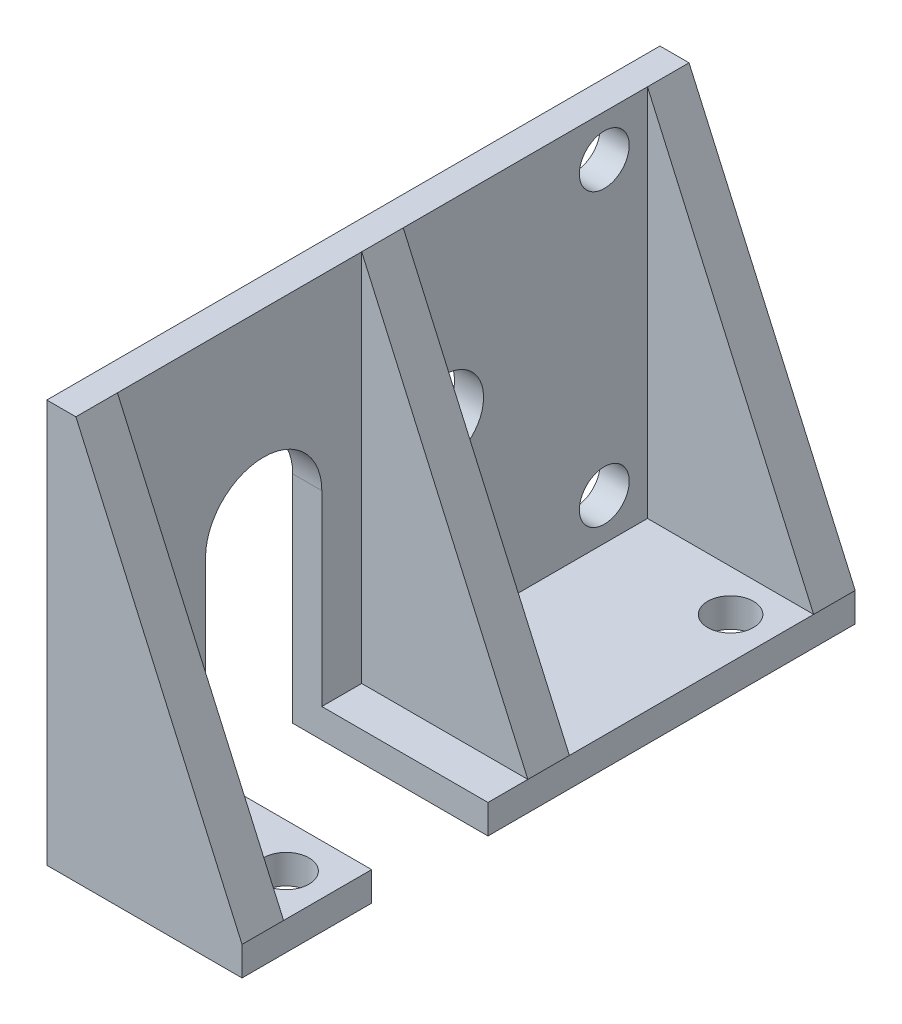
ISO-10303-21;
HEADER;
FILE_DESCRIPTION(('STEP AP214'),'2;1');
FILE_NAME('part.step','',(''),(''),'','','');
FILE_SCHEMA(('AUTOMOTIVE_DESIGN { 1 0 10303 214 1 1 1 1 }'));
ENDSEC;
DATA;
#1=APPLICATION_CONTEXT('core data for automotive mechanical design processes');
#2=APPLICATION_PROTOCOL_DEFINITION('international standard','automotive_design',2000,#1);
#3=PRODUCT_CONTEXT('',#1,'mechanical');
#4=PRODUCT('Part','Part','',(#3));
#5=PRODUCT_RELATED_PRODUCT_CATEGORY('part','',(#4));
#6=PRODUCT_DEFINITION_FORMATION('','',#4);
#7=PRODUCT_DEFINITION_CONTEXT('part definition',#1,'design');
#8=PRODUCT_DEFINITION('design','',#6,#7);
#9=PRODUCT_DEFINITION_SHAPE('','',#8);
#10=(LENGTH_UNIT() NAMED_UNIT(*) SI_UNIT(.MILLI.,.METRE.));
#11=(NAMED_UNIT(*) PLANE_ANGLE_UNIT() SI_UNIT($,.RADIAN.));
#12=(NAMED_UNIT(*) SI_UNIT($,.STERADIAN.) SOLID_ANGLE_UNIT());
#13=UNCERTAINTY_MEASURE_WITH_UNIT(LENGTH_MEASURE(1.E-05),#10,'distance_accuracy_value','');
#14=(GEOMETRIC_REPRESENTATION_CONTEXT(3) GLOBAL_UNCERTAINTY_ASSIGNED_CONTEXT((#13)) GLOBAL_UNIT_ASSIGNED_CONTEXT((#10,
#11,#12)) REPRESENTATION_CONTEXT('',''));
#15=CARTESIAN_POINT('',(0.,0.,0.));
#16=DIRECTION('',(0.,0.,1.));
#17=DIRECTION('',(1.,0.,0.));
#18=AXIS2_PLACEMENT_3D('',#15,#16,#17);
#19=CARTESIAN_POINT('',(0.,0.,0.));
#20=DIRECTION('',(0.,-1.,0.));
#21=DIRECTION('',(0.,0.,-1.));
#22=AXIS2_PLACEMENT_3D('',#19,#20,#21);
#23=PLANE('',#22);
#24=CARTESIAN_POINT('',(9.25000000000001,0.,-5.14999999999999));
#25=DIRECTION('',(0.,1.,0.));
#26=DIRECTION('',(0.,0.,-1.));
#27=AXIS2_PLACEMENT_3D('',#24,#25,#26);
#28=CIRCLE('',#27,1.375);
#29=CARTESIAN_POINT('',(9.25000000000001,0.,-6.52499999999999));
#30=VERTEX_POINT('',#29);
#31=EDGE_CURVE('E810',#30,#30,#28,.T.);
#32=ORIENTED_EDGE('',*,*,#31,.F.);
#33=EDGE_LOOP('',(#32));
#34=FACE_BOUND('',#33,.T.);
#35=DIRECTION('',(0.,0.,1.));
#36=VECTOR('',#35,1.);
#37=CARTESIAN_POINT('',(11.75,0.,0.));
#38=LINE('',#37,#36);
#39=CARTESIAN_POINT('',(11.75,0.,-7.79999999999999));
#40=VERTEX_POINT('',#39);
#41=CARTESIAN_POINT('',(11.75,0.,-2.5));
#42=VERTEX_POINT('',#41);
#43=EDGE_CURVE('E317',#40,#42,#38,.T.);
#44=ORIENTED_EDGE('',*,*,#43,.F.);
#45=DIRECTION('',(-1.,0.,0.));
#46=VECTOR('',#45,1.);
#47=CARTESIAN_POINT('',(0.,0.,-7.79999999999999));
#48=LINE('',#47,#46);
#49=CARTESIAN_POINT('',(1.75,0.,-7.79999999999999));
#50=VERTEX_POINT('',#49);
#51=EDGE_CURVE('E213',#40,#50,#48,.T.);
#52=ORIENTED_EDGE('',*,*,#51,.T.);
#53=DIRECTION('',(0.,0.,-1.));
#54=VECTOR('',#53,1.);
#55=CARTESIAN_POINT('',(1.75,0.,0.));
#56=LINE('',#55,#54);
#57=CARTESIAN_POINT('',(1.75,0.,-2.5));
#58=VERTEX_POINT('',#57);
#59=EDGE_CURVE('E326',#58,#50,#56,.T.);
#60=ORIENTED_EDGE('',*,*,#59,.F.);
#61=DIRECTION('',(-1.,0.,0.));
#62=VECTOR('',#61,1.);
#63=CARTESIAN_POINT('',(0.,0.,-2.5));
#64=LINE('',#63,#62);
#65=EDGE_CURVE('E11',#42,#58,#64,.T.);
#66=ORIENTED_EDGE('',*,*,#65,.F.);
#67=EDGE_LOOP('',(#44,#52,#60,#66));
#68=FACE_BOUND('',#67,.T.);
#69=ADVANCED_FACE('F38',(#34,#68),#23,.F.);
#70=CARTESIAN_POINT('',(11.75,-1.75,0.));
#71=DIRECTION('',(-1.,0.,0.));
#72=DIRECTION('',(0.,0.,1.));
#73=AXIS2_PLACEMENT_3D('',#70,#71,#72);
#74=PLANE('',#73);
#75=DIRECTION('',(0.,0.,1.));
#76=VECTOR('',#75,1.);
#77=CARTESIAN_POINT('',(11.75,-1.75,0.));
#78=LINE('',#77,#76);
#79=CARTESIAN_POINT('',(11.75,-1.75,-7.79999999999999));
#80=VERTEX_POINT('',#79);
#81=CARTESIAN_POINT('',(11.75,-1.75,0.));
#82=VERTEX_POINT('',#81);
#83=EDGE_CURVE('E302',#80,#82,#78,.T.);
#84=ORIENTED_EDGE('',*,*,#83,.F.);
#85=DIRECTION('',(0.,-1.,0.));
#86=VECTOR('',#85,1.);
#87=CARTESIAN_POINT('',(11.75,-1.75,-7.79999999999999));
#88=LINE('',#87,#86);
#89=EDGE_CURVE('E184',#40,#80,#88,.T.);
#90=ORIENTED_EDGE('',*,*,#89,.F.);
#91=ORIENTED_EDGE('',*,*,#43,.T.);
#92=CARTESIAN_POINT('',(11.75,0.,0.));
#93=VERTEX_POINT('',#92);
#94=EDGE_CURVE('E294',#42,#93,#38,.T.);
#95=ORIENTED_EDGE('',*,*,#94,.T.);
#96=DIRECTION('',(0.,1.,0.));
#97=VECTOR('',#96,1.);
#98=CARTESIAN_POINT('',(11.75,-1.75,0.));
#99=LINE('',#98,#97);
#100=EDGE_CURVE('E311',#82,#93,#99,.T.);
#101=ORIENTED_EDGE('',*,*,#100,.F.);
#102=EDGE_LOOP('',(#84,#90,#91,#95,#101));
#103=FACE_BOUND('',#102,.T.);
#104=ADVANCED_FACE('F373',(#103),#74,.F.);
#105=CARTESIAN_POINT('',(0.,-1.75,0.));
#106=DIRECTION('',(0.,-1.,0.));
#107=DIRECTION('',(0.,0.,-1.));
#108=AXIS2_PLACEMENT_3D('',#105,#106,#107);
#109=PLANE('',#108);
#110=CARTESIAN_POINT('',(9.25000000000001,-1.75,-5.14999999999999));
#111=DIRECTION('',(0.,1.,0.));
#112=DIRECTION('',(0.,0.,-1.));
#113=AXIS2_PLACEMENT_3D('',#110,#111,#112);
#114=CIRCLE('',#113,1.375);
#115=CARTESIAN_POINT('',(9.25000000000001,-1.75,-6.52499999999999));
#116=VERTEX_POINT('',#115);
#117=EDGE_CURVE('E806',#116,#116,#114,.T.);
#118=ORIENTED_EDGE('',*,*,#117,.T.);
#119=EDGE_LOOP('',(#118));
#120=FACE_BOUND('',#119,.T.);
#121=DIRECTION('',(1.,0.,0.));
#122=VECTOR('',#121,1.);
#123=CARTESIAN_POINT('',(0.,-1.75,-7.79999999999999));
#124=LINE('',#123,#122);
#125=CARTESIAN_POINT('',(0.,-1.75,-7.79999999999999));
#126=VERTEX_POINT('',#125);
#127=EDGE_CURVE('E199',#126,#80,#124,.T.);
#128=ORIENTED_EDGE('',*,*,#127,.T.);
#129=ORIENTED_EDGE('',*,*,#83,.T.);
#130=DIRECTION('',(-1.,0.,0.));
#131=VECTOR('',#130,1.);
#132=CARTESIAN_POINT('',(0.,-1.75,0.));
#133=LINE('',#132,#131);
#134=CARTESIAN_POINT('',(0.,-1.75,0.));
#135=VERTEX_POINT('',#134);
#136=EDGE_CURVE('E307',#82,#135,#133,.T.);
#137=ORIENTED_EDGE('',*,*,#136,.T.);
#138=DIRECTION('',(0.,0.,-1.));
#139=VECTOR('',#138,1.);
#140=CARTESIAN_POINT('',(0.,-1.75,0.));
#141=LINE('',#140,#139);
#142=EDGE_CURVE('E295',#135,#126,#141,.T.);
#143=ORIENTED_EDGE('',*,*,#142,.T.);
#144=EDGE_LOOP('',(#128,#129,#137,#143));
#145=FACE_BOUND('',#144,.T.);
#146=ADVANCED_FACE('F367',(#120,#145),#109,.T.);
#147=CARTESIAN_POINT('',(1.75,0.,0.));
#148=DIRECTION('',(-1.,0.,0.));
#149=DIRECTION('',(0.,0.,1.));
#150=AXIS2_PLACEMENT_3D('',#147,#148,#149);
#151=PLANE('',#150);
#152=CARTESIAN_POINT('',(1.75,11.25,-22.185));
#153=DIRECTION('',(1.,0.,0.));
#154=DIRECTION('',(0.,0.,1.));
#155=AXIS2_PLACEMENT_3D('',#152,#153,#154);
#156=CIRCLE('',#155,2.35);
#157=CARTESIAN_POINT('',(1.75,11.25,-19.835));
#158=VERTEX_POINT('',#157);
#159=EDGE_CURVE('E496',#158,#158,#156,.T.);
#160=ORIENTED_EDGE('',*,*,#159,.F.);
#161=EDGE_LOOP('',(#160));
#162=FACE_BOUND('',#161,.T.);
#163=CARTESIAN_POINT('',(1.75,2.5,-31.8));
#164=DIRECTION('',(1.,0.,0.));
#165=DIRECTION('',(0.,0.,1.));
#166=AXIS2_PLACEMENT_3D('',#163,#164,#165);
#167=CIRCLE('',#166,1.5);
#168=CARTESIAN_POINT('',(1.75,2.5,-30.3));
#169=VERTEX_POINT('',#168);
#170=EDGE_CURVE('E230',#169,#169,#167,.T.);
#171=ORIENTED_EDGE('',*,*,#170,.F.);
#172=EDGE_LOOP('',(#171));
#173=FACE_BOUND('',#172,.T.);
#174=CARTESIAN_POINT('',(1.75,20.,-31.8));
#175=DIRECTION('',(1.,0.,0.));
#176=DIRECTION('',(0.,0.,1.));
#177=AXIS2_PLACEMENT_3D('',#174,#175,#176);
#178=CIRCLE('',#177,1.5);
#179=CARTESIAN_POINT('',(1.75,20.,-30.3));
#180=VERTEX_POINT('',#179);
#181=EDGE_CURVE('E224',#180,#180,#178,.T.);
#182=ORIENTED_EDGE('',*,*,#181,.F.);
#183=EDGE_LOOP('',(#182));
#184=FACE_BOUND('',#183,.T.);
#185=DIRECTION('',(0.,1.,0.));
#186=VECTOR('',#185,1.);
#187=CARTESIAN_POINT('',(1.75,0.,-19.7));
#188=LINE('',#187,#186);
#189=CARTESIAN_POINT('',(1.75,0.,-19.7));
#190=VERTEX_POINT('',#189);
#191=CARTESIAN_POINT('',(1.75,22.5,-19.7));
#192=VERTEX_POINT('',#191);
#193=EDGE_CURVE('E249',#190,#192,#188,.T.);
#194=ORIENTED_EDGE('',*,*,#193,.F.);
#195=CARTESIAN_POINT('',(1.75,0.,-34.4));
#196=VERTEX_POINT('',#195);
#197=EDGE_CURVE('E332',#190,#196,#56,.T.);
#198=ORIENTED_EDGE('',*,*,#197,.T.);
#199=DIRECTION('',(0.,-1.,0.));
#200=VECTOR('',#199,1.);
#201=CARTESIAN_POINT('',(1.75,0.,-34.4));
#202=LINE('',#201,#200);
#203=CARTESIAN_POINT('',(1.75,22.5,-34.4));
#204=VERTEX_POINT('',#203);
#205=EDGE_CURVE('E274',#204,#196,#202,.T.);
#206=ORIENTED_EDGE('',*,*,#205,.F.);
#207=DIRECTION('',(0.,0.,1.));
#208=VECTOR('',#207,1.);
#209=CARTESIAN_POINT('',(1.75,22.5,0.));
#210=LINE('',#209,#208);
#211=EDGE_CURVE('E337',#204,#192,#210,.T.);
#212=ORIENTED_EDGE('',*,*,#211,.T.);
#213=EDGE_LOOP('',(#194,#198,#206,#212));
#214=FACE_BOUND('',#213,.T.);
#215=ADVANCED_FACE('F395',(#162,#173,#184,#214),#151,.F.);
#216=CARTESIAN_POINT('',(9.25,0.,-31.9));
#217=DIRECTION('',(0.,1.,0.));
#218=DIRECTION('',(0.,0.,-1.));
#219=AXIS2_PLACEMENT_3D('',#216,#217,#218);
#220=CIRCLE('',#219,1.375);
#221=CARTESIAN_POINT('',(9.25,0.,-33.275));
#222=VERTEX_POINT('',#221);
#223=EDGE_CURVE('E802',#222,#222,#220,.T.);
#224=ORIENTED_EDGE('',*,*,#223,.F.);
#225=EDGE_LOOP('',(#224));
#226=FACE_BOUND('',#225,.T.);
#227=CARTESIAN_POINT('',(4.25,0.,-22.2));
#228=DIRECTION('',(0.,1.,0.));
#229=DIRECTION('',(0.,0.,-1.));
#230=AXIS2_PLACEMENT_3D('',#227,#228,#229);
#231=CIRCLE('',#230,1.375);
#232=CARTESIAN_POINT('',(4.25,0.,-23.575));
#233=VERTEX_POINT('',#232);
#234=EDGE_CURVE('E191',#233,#233,#231,.T.);
#235=ORIENTED_EDGE('',*,*,#234,.F.);
#236=EDGE_LOOP('',(#235));
#237=FACE_BOUND('',#236,.T.);
#238=DIRECTION('',(-1.,0.,0.));
#239=VECTOR('',#238,1.);
#240=CARTESIAN_POINT('',(0.,0.,-19.7));
#241=LINE('',#240,#239);
#242=CARTESIAN_POINT('',(11.75,0.,-19.7));
#243=VERTEX_POINT('',#242);
#244=EDGE_CURVE('E243',#243,#190,#241,.T.);
#245=ORIENTED_EDGE('',*,*,#244,.F.);
#246=CARTESIAN_POINT('',(11.75,0.,-34.4));
#247=VERTEX_POINT('',#246);
#248=EDGE_CURVE('E316',#247,#243,#38,.T.);
#249=ORIENTED_EDGE('',*,*,#248,.F.);
#250=DIRECTION('',(1.,0.,0.));
#251=VECTOR('',#250,1.);
#252=CARTESIAN_POINT('',(0.,0.,-34.4));
#253=LINE('',#252,#251);
#254=EDGE_CURVE('E268',#196,#247,#253,.T.);
#255=ORIENTED_EDGE('',*,*,#254,.F.);
#256=ORIENTED_EDGE('',*,*,#197,.F.);
#257=EDGE_LOOP('',(#245,#249,#255,#256));
#258=FACE_BOUND('',#257,.T.);
#259=ADVANCED_FACE('F437',(#226,#237,#258),#23,.F.);
#260=ORIENTED_EDGE('',*,*,#59,.T.);
#261=DIRECTION('',(0.,1.,0.));
#262=VECTOR('',#261,1.);
#263=CARTESIAN_POINT('',(1.75,0.,-7.79999999999999));
#264=LINE('',#263,#262);
#265=CARTESIAN_POINT('',(1.75,11.25,-7.79999999999999));
#266=VERTEX_POINT('',#265);
#267=EDGE_CURVE('E217',#50,#266,#264,.T.);
#268=ORIENTED_EDGE('',*,*,#267,.T.);
#269=CARTESIAN_POINT('',(1.75,11.25,-11.3));
#270=DIRECTION('',(-1.,0.,0.));
#271=DIRECTION('',(0.,0.,1.));
#272=AXIS2_PLACEMENT_3D('',#269,#270,#271);
#273=CIRCLE('',#272,3.5);
#274=CARTESIAN_POINT('',(1.75,11.25,-14.8));
#275=VERTEX_POINT('',#274);
#276=EDGE_CURVE('E221',#266,#275,#273,.T.);
#277=ORIENTED_EDGE('',*,*,#276,.T.);
#278=DIRECTION('',(0.,-1.,0.));
#279=VECTOR('',#278,1.);
#280=CARTESIAN_POINT('',(1.75,0.,-14.8));
#281=LINE('',#280,#279);
#282=CARTESIAN_POINT('',(1.75,0.,-14.8));
#283=VERTEX_POINT('',#282);
#284=EDGE_CURVE('E161',#275,#283,#281,.T.);
#285=ORIENTED_EDGE('',*,*,#284,.T.);
#286=CARTESIAN_POINT('',(1.75,0.,-17.2));
#287=VERTEX_POINT('',#286);
#288=EDGE_CURVE('E331',#283,#287,#56,.T.);
#289=ORIENTED_EDGE('',*,*,#288,.T.);
#290=DIRECTION('',(0.,1.,0.));
#291=VECTOR('',#290,1.);
#292=CARTESIAN_POINT('',(1.75,0.,-17.2));
#293=LINE('',#292,#291);
#294=CARTESIAN_POINT('',(1.75,22.5,-17.2));
#295=VERTEX_POINT('',#294);
#296=EDGE_CURVE('E256',#287,#295,#293,.T.);
#297=ORIENTED_EDGE('',*,*,#296,.T.);
#298=CARTESIAN_POINT('',(1.75,22.5,-2.5));
#299=VERTEX_POINT('',#298);
#300=EDGE_CURVE('E330',#295,#299,#210,.T.);
#301=ORIENTED_EDGE('',*,*,#300,.T.);
#302=DIRECTION('',(0.,1.,0.));
#303=VECTOR('',#302,1.);
#304=CARTESIAN_POINT('',(1.75,0.,-2.5));
#305=LINE('',#304,#303);
#306=EDGE_CURVE('E283',#58,#299,#305,.T.);
#307=ORIENTED_EDGE('',*,*,#306,.F.);
#308=EDGE_LOOP('',(#260,#268,#277,#285,#289,#297,#301,#307));
#309=FACE_BOUND('',#308,.T.);
#310=ADVANCED_FACE('F385',(#309),#151,.F.);
#311=ORIENTED_EDGE('',*,*,#288,.F.);
#312=DIRECTION('',(1.,0.,0.));
#313=VECTOR('',#312,1.);
#314=CARTESIAN_POINT('',(0.,0.,-14.8));
#315=LINE('',#314,#313);
#316=CARTESIAN_POINT('',(11.75,0.,-14.8));
#317=VERTEX_POINT('',#316);
#318=EDGE_CURVE('E203',#283,#317,#315,.T.);
#319=ORIENTED_EDGE('',*,*,#318,.T.);
#320=CARTESIAN_POINT('',(11.75,0.,-17.2));
#321=VERTEX_POINT('',#320);
#322=EDGE_CURVE('E405',#321,#317,#38,.T.);
#323=ORIENTED_EDGE('',*,*,#322,.F.);
#324=DIRECTION('',(-1.,0.,0.));
#325=VECTOR('',#324,1.);
#326=CARTESIAN_POINT('',(0.,0.,-17.2));
#327=LINE('',#326,#325);
#328=EDGE_CURVE('E252',#321,#287,#327,.T.);
#329=ORIENTED_EDGE('',*,*,#328,.T.);
#330=EDGE_LOOP('',(#311,#319,#323,#329));
#331=FACE_BOUND('',#330,.T.);
#332=ADVANCED_FACE('F407',(#331),#23,.F.);
#333=CARTESIAN_POINT('',(1.75,0.,0.));
#334=DIRECTION('',(0.,0.,-1.));
#335=DIRECTION('',(-1.,0.,0.));
#336=AXIS2_PLACEMENT_3D('',#333,#334,#335);
#337=PLANE('',#336);
#338=DIRECTION('',(0.,-1.,0.));
#339=VECTOR('',#338,1.);
#340=CARTESIAN_POINT('',(0.,0.,0.));
#341=LINE('',#340,#339);
#342=CARTESIAN_POINT('',(0.,22.5,0.));
#343=VERTEX_POINT('',#342);
#344=EDGE_CURVE('E325',#343,#135,#341,.T.);
#345=ORIENTED_EDGE('',*,*,#344,.T.);
#346=ORIENTED_EDGE('',*,*,#136,.F.);
#347=ORIENTED_EDGE('',*,*,#100,.T.);
#348=DIRECTION('',(0.406138466053448,-0.913811548620257,0.));
#349=VECTOR('',#348,1.);
#350=CARTESIAN_POINT('',(1.75,22.5,0.));
#351=LINE('',#350,#349);
#352=CARTESIAN_POINT('',(1.75,22.5,0.));
#353=VERTEX_POINT('',#352);
#354=EDGE_CURVE('E279',#353,#93,#351,.T.);
#355=ORIENTED_EDGE('',*,*,#354,.F.);
#356=DIRECTION('',(-1.,0.,0.));
#357=VECTOR('',#356,1.);
#358=CARTESIAN_POINT('',(1.75,22.5,0.));
#359=LINE('',#358,#357);
#360=EDGE_CURVE('E336',#353,#343,#359,.T.);
#361=ORIENTED_EDGE('',*,*,#360,.T.);
#362=EDGE_LOOP('',(#345,#346,#347,#355,#361));
#363=FACE_BOUND('',#362,.T.);
#364=ADVANCED_FACE('F40',(#363),#337,.F.);
#365=CARTESIAN_POINT('',(1.75,0.,-36.9));
#366=DIRECTION('',(0.,0.,1.));
#367=DIRECTION('',(1.,0.,0.));
#368=AXIS2_PLACEMENT_3D('',#365,#366,#367);
#369=PLANE('',#368);
#370=DIRECTION('',(-1.,0.,0.));
#371=VECTOR('',#370,1.);
#372=CARTESIAN_POINT('',(1.75,22.5,-36.9));
#373=LINE('',#372,#371);
#374=CARTESIAN_POINT('',(1.75,22.5,-36.9));
#375=VERTEX_POINT('',#374);
#376=CARTESIAN_POINT('',(0.,22.5,-36.9));
#377=VERTEX_POINT('',#376);
#378=EDGE_CURVE('E48',#375,#377,#373,.T.);
#379=ORIENTED_EDGE('',*,*,#378,.F.);
#380=DIRECTION('',(0.406138466053448,-0.913811548620257,0.));
#381=VECTOR('',#380,1.);
#382=CARTESIAN_POINT('',(1.75,22.5,-36.9));
#383=LINE('',#382,#381);
#384=CARTESIAN_POINT('',(11.75,0.,-36.9));
#385=VERTEX_POINT('',#384);
#386=EDGE_CURVE('E264',#375,#385,#383,.T.);
#387=ORIENTED_EDGE('',*,*,#386,.T.);
#388=DIRECTION('',(0.,1.,0.));
#389=VECTOR('',#388,1.);
#390=CARTESIAN_POINT('',(11.75,-1.75,-36.9));
#391=LINE('',#390,#389);
#392=CARTESIAN_POINT('',(11.75,-1.75,-36.9));
#393=VERTEX_POINT('',#392);
#394=EDGE_CURVE('E321',#393,#385,#391,.T.);
#395=ORIENTED_EDGE('',*,*,#394,.F.);
#396=DIRECTION('',(1.,0.,0.));
#397=VECTOR('',#396,1.);
#398=CARTESIAN_POINT('',(0.,-1.75,-36.9));
#399=LINE('',#398,#397);
#400=CARTESIAN_POINT('',(0.,-1.75,-36.9));
#401=VERTEX_POINT('',#400);
#402=EDGE_CURVE('E299',#401,#393,#399,.T.);
#403=ORIENTED_EDGE('',*,*,#402,.F.);
#404=DIRECTION('',(0.,1.,0.));
#405=VECTOR('',#404,1.);
#406=CARTESIAN_POINT('',(0.,0.,-36.9));
#407=LINE('',#406,#405);
#408=EDGE_CURVE('E340',#401,#377,#407,.T.);
#409=ORIENTED_EDGE('',*,*,#408,.T.);
#410=EDGE_LOOP('',(#379,#387,#395,#403,#409));
#411=FACE_BOUND('',#410,.T.);
#412=ADVANCED_FACE('F442',(#411),#369,.F.);
#413=CARTESIAN_POINT('',(1.75,22.5,0.));
#414=DIRECTION('',(0.,-1.,0.));
#415=DIRECTION('',(0.,0.,-1.));
#416=AXIS2_PLACEMENT_3D('',#413,#414,#415);
#417=PLANE('',#416);
#418=ORIENTED_EDGE('',*,*,#300,.F.);
#419=DIRECTION('',(0.,0.,-1.));
#420=VECTOR('',#419,1.);
#421=CARTESIAN_POINT('',(1.75,22.5,0.));
#422=LINE('',#421,#420);
#423=EDGE_CURVE('E260',#192,#295,#422,.F.);
#424=ORIENTED_EDGE('',*,*,#423,.F.);
#425=ORIENTED_EDGE('',*,*,#211,.F.);
#426=EDGE_CURVE('E333',#375,#204,#210,.T.);
#427=ORIENTED_EDGE('',*,*,#426,.F.);
#428=ORIENTED_EDGE('',*,*,#378,.T.);
#429=DIRECTION('',(0.,0.,1.));
#430=VECTOR('',#429,1.);
#431=CARTESIAN_POINT('',(0.,22.5,0.));
#432=LINE('',#431,#430);
#433=EDGE_CURVE('E343',#377,#343,#432,.T.);
#434=ORIENTED_EDGE('',*,*,#433,.T.);
#435=ORIENTED_EDGE('',*,*,#360,.F.);
#436=DIRECTION('',(0.,0.,1.));
#437=VECTOR('',#436,1.);
#438=CARTESIAN_POINT('',(1.75,22.5,0.));
#439=LINE('',#438,#437);
#440=EDGE_CURVE('E290',#353,#299,#439,.F.);
#441=ORIENTED_EDGE('',*,*,#440,.T.);
#442=EDGE_LOOP('',(#418,#424,#425,#427,#428,#434,#435,#441));
#443=FACE_BOUND('',#442,.T.);
#444=ADVANCED_FACE('F357',(#443),#417,.F.);
#445=CARTESIAN_POINT('',(0.,0.,0.));
#446=DIRECTION('',(-1.,0.,0.));
#447=DIRECTION('',(0.,0.,1.));
#448=AXIS2_PLACEMENT_3D('',#445,#446,#447);
#449=PLANE('',#448);
#450=CARTESIAN_POINT('',(0.,11.25,-22.185));
#451=DIRECTION('',(-1.,0.,0.));
#452=DIRECTION('',(0.,0.,1.));
#453=AXIS2_PLACEMENT_3D('',#450,#451,#452);
#454=CIRCLE('',#453,2.35);
#455=CARTESIAN_POINT('',(0.,11.25,-19.835));
#456=VERTEX_POINT('',#455);
#457=EDGE_CURVE('E42',#456,#456,#454,.T.);
#458=ORIENTED_EDGE('',*,*,#457,.F.);
#459=EDGE_LOOP('',(#458));
#460=FACE_BOUND('',#459,.T.);
#461=DIRECTION('',(0.,-1.,0.));
#462=VECTOR('',#461,1.);
#463=CARTESIAN_POINT('',(0.,-1.75,-7.79999999999999));
#464=LINE('',#463,#462);
#465=CARTESIAN_POINT('',(0.,11.25,-7.79999999999999));
#466=VERTEX_POINT('',#465);
#467=EDGE_CURVE('E176',#466,#126,#464,.T.);
#468=ORIENTED_EDGE('',*,*,#467,.T.);
#469=ORIENTED_EDGE('',*,*,#142,.F.);
#470=ORIENTED_EDGE('',*,*,#344,.F.);
#471=ORIENTED_EDGE('',*,*,#433,.F.);
#472=ORIENTED_EDGE('',*,*,#408,.F.);
#473=CARTESIAN_POINT('',(0.,-1.75,-14.8));
#474=VERTEX_POINT('',#473);
#475=EDGE_CURVE('E182',#474,#401,#141,.T.);
#476=ORIENTED_EDGE('',*,*,#475,.F.);
#477=DIRECTION('',(0.,1.,0.));
#478=VECTOR('',#477,1.);
#479=CARTESIAN_POINT('',(0.,-1.75,-14.8));
#480=LINE('',#479,#478);
#481=CARTESIAN_POINT('',(0.,11.25,-14.8));
#482=VERTEX_POINT('',#481);
#483=EDGE_CURVE('E55',#474,#482,#480,.T.);
#484=ORIENTED_EDGE('',*,*,#483,.T.);
#485=CARTESIAN_POINT('',(0.,11.25,-11.3));
#486=DIRECTION('',(1.,0.,0.));
#487=DIRECTION('',(0.,0.,1.));
#488=AXIS2_PLACEMENT_3D('',#485,#486,#487);
#489=CIRCLE('',#488,3.5);
#490=EDGE_CURVE('E169',#482,#466,#489,.T.);
#491=ORIENTED_EDGE('',*,*,#490,.T.);
#492=EDGE_LOOP('',(#468,#469,#470,#471,#472,#476,#484,#491));
#493=FACE_BOUND('',#492,.T.);
#494=CARTESIAN_POINT('',(0.,2.5,-31.8));
#495=DIRECTION('',(1.,0.,0.));
#496=DIRECTION('',(0.,0.,1.));
#497=AXIS2_PLACEMENT_3D('',#494,#495,#496);
#498=CIRCLE('',#497,1.5);
#499=CARTESIAN_POINT('',(0.,2.5,-30.3));
#500=VERTEX_POINT('',#499);
#501=EDGE_CURVE('E225',#500,#500,#498,.T.);
#502=ORIENTED_EDGE('',*,*,#501,.T.);
#503=EDGE_LOOP('',(#502));
#504=FACE_BOUND('',#503,.T.);
#505=CARTESIAN_POINT('',(0.,20.,-31.8));
#506=DIRECTION('',(1.,0.,0.));
#507=DIRECTION('',(0.,0.,1.));
#508=AXIS2_PLACEMENT_3D('',#505,#506,#507);
#509=CIRCLE('',#508,1.5);
#510=CARTESIAN_POINT('',(0.,20.,-30.3));
#511=VERTEX_POINT('',#510);
#512=EDGE_CURVE('E234',#511,#511,#509,.T.);
#513=ORIENTED_EDGE('',*,*,#512,.T.);
#514=EDGE_LOOP('',(#513));
#515=FACE_BOUND('',#514,.T.);
#516=ADVANCED_FACE('F179',(#460,#493,#504,#515),#449,.T.);
#517=ORIENTED_EDGE('',*,*,#322,.T.);
#518=DIRECTION('',(0.,1.,0.));
#519=VECTOR('',#518,1.);
#520=CARTESIAN_POINT('',(11.75,-1.75,-14.8));
#521=LINE('',#520,#519);
#522=CARTESIAN_POINT('',(11.75,-1.75,-14.8));
#523=VERTEX_POINT('',#522);
#524=EDGE_CURVE('E188',#523,#317,#521,.T.);
#525=ORIENTED_EDGE('',*,*,#524,.F.);
#526=EDGE_CURVE('E303',#393,#523,#78,.T.);
#527=ORIENTED_EDGE('',*,*,#526,.F.);
#528=ORIENTED_EDGE('',*,*,#394,.T.);
#529=EDGE_CURVE('E312',#385,#247,#38,.T.);
#530=ORIENTED_EDGE('',*,*,#529,.T.);
#531=ORIENTED_EDGE('',*,*,#248,.T.);
#532=EDGE_CURVE('E411',#243,#321,#38,.T.);
#533=ORIENTED_EDGE('',*,*,#532,.T.);
#534=EDGE_LOOP('',(#517,#525,#527,#528,#530,#531,#533));
#535=FACE_BOUND('',#534,.T.);
#536=ADVANCED_FACE('F413',(#535),#74,.F.);
#537=CARTESIAN_POINT('',(9.25,-1.75,-31.9));
#538=DIRECTION('',(0.,1.,0.));
#539=DIRECTION('',(0.,0.,-1.));
#540=AXIS2_PLACEMENT_3D('',#537,#538,#539);
#541=CIRCLE('',#540,1.375);
#542=CARTESIAN_POINT('',(9.25,-1.75,-33.275));
#543=VERTEX_POINT('',#542);
#544=EDGE_CURVE('E197',#543,#543,#541,.T.);
#545=ORIENTED_EDGE('',*,*,#544,.T.);
#546=EDGE_LOOP('',(#545));
#547=FACE_BOUND('',#546,.T.);
#548=CARTESIAN_POINT('',(4.25,-1.75,-22.2));
#549=DIRECTION('',(0.,1.,0.));
#550=DIRECTION('',(0.,0.,-1.));
#551=AXIS2_PLACEMENT_3D('',#548,#549,#550);
#552=CIRCLE('',#551,1.375);
#553=CARTESIAN_POINT('',(4.25,-1.75,-23.575));
#554=VERTEX_POINT('',#553);
#555=EDGE_CURVE('E795',#554,#554,#552,.T.);
#556=ORIENTED_EDGE('',*,*,#555,.T.);
#557=EDGE_LOOP('',(#556));
#558=FACE_BOUND('',#557,.T.);
#559=DIRECTION('',(1.,0.,0.));
#560=VECTOR('',#559,1.);
#561=CARTESIAN_POINT('',(0.,-1.75,-14.8));
#562=LINE('',#561,#560);
#563=EDGE_CURVE('E166',#474,#523,#562,.T.);
#564=ORIENTED_EDGE('',*,*,#563,.F.);
#565=ORIENTED_EDGE('',*,*,#475,.T.);
#566=ORIENTED_EDGE('',*,*,#402,.T.);
#567=ORIENTED_EDGE('',*,*,#526,.T.);
#568=EDGE_LOOP('',(#564,#565,#566,#567));
#569=FACE_BOUND('',#568,.T.);
#570=ADVANCED_FACE('F444',(#547,#558,#569),#109,.T.);
#571=CARTESIAN_POINT('',(1.75,22.5,0.));
#572=DIRECTION('',(-0.913811548620257,-0.406138466053448,0.));
#573=DIRECTION('',(0.406138466053448,-0.913811548620257,0.));
#574=AXIS2_PLACEMENT_3D('',#571,#572,#573);
#575=PLANE('',#574);
#576=ORIENTED_EDGE('',*,*,#440,.F.);
#577=ORIENTED_EDGE('',*,*,#354,.T.);
#578=ORIENTED_EDGE('',*,*,#94,.F.);
#579=DIRECTION('',(0.406138466053448,-0.913811548620257,0.));
#580=VECTOR('',#579,1.);
#581=CARTESIAN_POINT('',(1.75,22.5,-2.5));
#582=LINE('',#581,#580);
#583=EDGE_CURVE('E278',#299,#42,#582,.T.);
#584=ORIENTED_EDGE('',*,*,#583,.F.);
#585=EDGE_LOOP('',(#576,#577,#578,#584));
#586=FACE_BOUND('',#585,.T.);
#587=ADVANCED_FACE('F377',(#586),#575,.F.);
#588=CARTESIAN_POINT('',(5.875,10.375,-2.5));
#589=DIRECTION('',(0.,0.,1.));
#590=DIRECTION('',(1.,0.,0.));
#591=AXIS2_PLACEMENT_3D('',#588,#589,#590);
#592=PLANE('',#591);
#593=ORIENTED_EDGE('',*,*,#65,.T.);
#594=ORIENTED_EDGE('',*,*,#306,.T.);
#595=ORIENTED_EDGE('',*,*,#583,.T.);
#596=EDGE_LOOP('',(#593,#594,#595));
#597=FACE_BOUND('',#596,.T.);
#598=ADVANCED_FACE('F382',(#597),#592,.F.);
#599=CARTESIAN_POINT('',(5.875,10.375,-34.4));
#600=DIRECTION('',(0.,0.,-1.));
#601=DIRECTION('',(-1.,0.,0.));
#602=AXIS2_PLACEMENT_3D('',#599,#600,#601);
#603=PLANE('',#602);
#604=DIRECTION('',(0.406138466053448,-0.913811548620257,0.));
#605=VECTOR('',#604,1.);
#606=CARTESIAN_POINT('',(1.75,22.5,-34.4));
#607=LINE('',#606,#605);
#608=EDGE_CURVE('E263',#204,#247,#607,.T.);
#609=ORIENTED_EDGE('',*,*,#608,.F.);
#610=ORIENTED_EDGE('',*,*,#205,.T.);
#611=ORIENTED_EDGE('',*,*,#254,.T.);
#612=EDGE_LOOP('',(#609,#610,#611));
#613=FACE_BOUND('',#612,.T.);
#614=ADVANCED_FACE('F436',(#613),#603,.F.);
#615=CARTESIAN_POINT('',(1.75,22.5,-36.9));
#616=DIRECTION('',(0.913811548620257,0.406138466053448,0.));
#617=DIRECTION('',(0.406138466053448,-0.913811548620257,0.));
#618=AXIS2_PLACEMENT_3D('',#615,#616,#617);
#619=PLANE('',#618);
#620=ORIENTED_EDGE('',*,*,#386,.F.);
#621=ORIENTED_EDGE('',*,*,#426,.T.);
#622=ORIENTED_EDGE('',*,*,#608,.T.);
#623=ORIENTED_EDGE('',*,*,#529,.F.);
#624=EDGE_LOOP('',(#620,#621,#622,#623));
#625=FACE_BOUND('',#624,.T.);
#626=ADVANCED_FACE('F441',(#625),#619,.T.);
#627=CARTESIAN_POINT('',(5.875,10.375,-17.2));
#628=DIRECTION('',(0.,0.,1.));
#629=DIRECTION('',(1.,0.,0.));
#630=AXIS2_PLACEMENT_3D('',#627,#628,#629);
#631=PLANE('',#630);
#632=ORIENTED_EDGE('',*,*,#296,.F.);
#633=ORIENTED_EDGE('',*,*,#328,.F.);
#634=DIRECTION('',(0.406138466053448,-0.913811548620257,0.));
#635=VECTOR('',#634,1.);
#636=CARTESIAN_POINT('',(1.75,22.5,-17.2));
#637=LINE('',#636,#635);
#638=EDGE_CURVE('E63',#295,#321,#637,.T.);
#639=ORIENTED_EDGE('',*,*,#638,.F.);
#640=EDGE_LOOP('',(#632,#633,#639));
#641=FACE_BOUND('',#640,.T.);
#642=ADVANCED_FACE('F400',(#641),#631,.T.);
#643=CARTESIAN_POINT('',(5.875,10.375,-19.7));
#644=DIRECTION('',(0.,0.,1.));
#645=DIRECTION('',(1.,0.,0.));
#646=AXIS2_PLACEMENT_3D('',#643,#644,#645);
#647=PLANE('',#646);
#648=ORIENTED_EDGE('',*,*,#244,.T.);
#649=ORIENTED_EDGE('',*,*,#193,.T.);
#650=DIRECTION('',(0.406138466053448,-0.913811548620257,0.));
#651=VECTOR('',#650,1.);
#652=CARTESIAN_POINT('',(1.75,22.5,-19.7));
#653=LINE('',#652,#651);
#654=EDGE_CURVE('E229',#192,#243,#653,.T.);
#655=ORIENTED_EDGE('',*,*,#654,.T.);
#656=EDGE_LOOP('',(#648,#649,#655));
#657=FACE_BOUND('',#656,.T.);
#658=ADVANCED_FACE('F512',(#657),#647,.F.);
#659=CARTESIAN_POINT('',(1.75,22.5,-18.45));
#660=DIRECTION('',(-0.913811548620257,-0.406138466053448,0.));
#661=DIRECTION('',(0.406138466053448,-0.913811548620257,0.));
#662=AXIS2_PLACEMENT_3D('',#659,#660,#661);
#663=PLANE('',#662);
#664=ORIENTED_EDGE('',*,*,#654,.F.);
#665=ORIENTED_EDGE('',*,*,#423,.T.);
#666=ORIENTED_EDGE('',*,*,#638,.T.);
#667=ORIENTED_EDGE('',*,*,#532,.F.);
#668=EDGE_LOOP('',(#664,#665,#666,#667));
#669=FACE_BOUND('',#668,.T.);
#670=ADVANCED_FACE('F398',(#669),#663,.F.);
#671=CARTESIAN_POINT('',(0.,20.,-31.8));
#672=DIRECTION('',(1.,0.,0.));
#673=DIRECTION('',(0.,0.,-1.));
#674=AXIS2_PLACEMENT_3D('',#671,#672,#673);
#675=CYLINDRICAL_SURFACE('',#674,1.5);
#676=ORIENTED_EDGE('',*,*,#512,.F.);
#677=EDGE_LOOP('',(#676));
#678=FACE_BOUND('',#677,.T.);
#679=ORIENTED_EDGE('',*,*,#181,.T.);
#680=EDGE_LOOP('',(#679));
#681=FACE_BOUND('',#680,.T.);
#682=ADVANCED_FACE('F501',(#678,#681),#675,.F.);
#683=CARTESIAN_POINT('',(0.,2.5,-31.8));
#684=DIRECTION('',(1.,0.,0.));
#685=DIRECTION('',(0.,0.,-1.));
#686=AXIS2_PLACEMENT_3D('',#683,#684,#685);
#687=CYLINDRICAL_SURFACE('',#686,1.5);
#688=ORIENTED_EDGE('',*,*,#501,.F.);
#689=EDGE_LOOP('',(#688));
#690=FACE_BOUND('',#689,.T.);
#691=ORIENTED_EDGE('',*,*,#170,.T.);
#692=EDGE_LOOP('',(#691));
#693=FACE_BOUND('',#692,.T.);
#694=ADVANCED_FACE('F503',(#690,#693),#687,.F.);
#695=CARTESIAN_POINT('',(0.,11.25,-11.3));
#696=DIRECTION('',(1.,0.,0.));
#697=DIRECTION('',(0.,0.,-1.));
#698=AXIS2_PLACEMENT_3D('',#695,#696,#697);
#699=CYLINDRICAL_SURFACE('',#698,3.5);
#700=DIRECTION('',(1.,0.,0.));
#701=VECTOR('',#700,1.);
#702=CARTESIAN_POINT('',(0.,11.25,-7.79999999999999));
#703=LINE('',#702,#701);
#704=EDGE_CURVE('E165',#466,#266,#703,.T.);
#705=ORIENTED_EDGE('',*,*,#704,.F.);
#706=ORIENTED_EDGE('',*,*,#490,.F.);
#707=DIRECTION('',(1.,0.,0.));
#708=VECTOR('',#707,1.);
#709=CARTESIAN_POINT('',(0.,11.25,-14.8));
#710=LINE('',#709,#708);
#711=EDGE_CURVE('E157',#482,#275,#710,.T.);
#712=ORIENTED_EDGE('',*,*,#711,.T.);
#713=ORIENTED_EDGE('',*,*,#276,.F.);
#714=EDGE_LOOP('',(#705,#706,#712,#713));
#715=FACE_BOUND('',#714,.T.);
#716=ADVANCED_FACE('F170',(#715),#699,.F.);
#717=CARTESIAN_POINT('',(0.,-1.75,-7.79999999999999));
#718=DIRECTION('',(0.,0.,1.));
#719=DIRECTION('',(1.,0.,0.));
#720=AXIS2_PLACEMENT_3D('',#717,#718,#719);
#721=PLANE('',#720);
#722=ORIENTED_EDGE('',*,*,#51,.F.);
#723=ORIENTED_EDGE('',*,*,#89,.T.);
#724=ORIENTED_EDGE('',*,*,#127,.F.);
#725=ORIENTED_EDGE('',*,*,#467,.F.);
#726=ORIENTED_EDGE('',*,*,#704,.T.);
#727=ORIENTED_EDGE('',*,*,#267,.F.);
#728=EDGE_LOOP('',(#722,#723,#724,#725,#726,#727));
#729=FACE_BOUND('',#728,.T.);
#730=ADVANCED_FACE('F426',(#729),#721,.F.);
#731=CARTESIAN_POINT('',(0.,-1.75,-14.8));
#732=DIRECTION('',(0.,0.,-1.));
#733=DIRECTION('',(-1.,0.,0.));
#734=AXIS2_PLACEMENT_3D('',#731,#732,#733);
#735=PLANE('',#734);
#736=ORIENTED_EDGE('',*,*,#711,.F.);
#737=ORIENTED_EDGE('',*,*,#483,.F.);
#738=ORIENTED_EDGE('',*,*,#563,.T.);
#739=ORIENTED_EDGE('',*,*,#524,.T.);
#740=ORIENTED_EDGE('',*,*,#318,.F.);
#741=ORIENTED_EDGE('',*,*,#284,.F.);
#742=EDGE_LOOP('',(#736,#737,#738,#739,#740,#741));
#743=FACE_BOUND('',#742,.T.);
#744=ADVANCED_FACE('F159',(#743),#735,.F.);
#745=CARTESIAN_POINT('',(4.25,-1.75,-22.2));
#746=DIRECTION('',(0.,1.,0.));
#747=DIRECTION('',(0.,0.,1.));
#748=AXIS2_PLACEMENT_3D('',#745,#746,#747);
#749=CYLINDRICAL_SURFACE('',#748,1.375);
#750=ORIENTED_EDGE('',*,*,#555,.F.);
#751=EDGE_LOOP('',(#750));
#752=FACE_BOUND('',#751,.T.);
#753=ORIENTED_EDGE('',*,*,#234,.T.);
#754=EDGE_LOOP('',(#753));
#755=FACE_BOUND('',#754,.T.);
#756=ADVANCED_FACE('F588',(#752,#755),#749,.F.);
#757=CARTESIAN_POINT('',(9.25,-1.75,-31.9));
#758=DIRECTION('',(0.,1.,0.));
#759=DIRECTION('',(0.,0.,1.));
#760=AXIS2_PLACEMENT_3D('',#757,#758,#759);
#761=CYLINDRICAL_SURFACE('',#760,1.375);
#762=ORIENTED_EDGE('',*,*,#544,.F.);
#763=EDGE_LOOP('',(#762));
#764=FACE_BOUND('',#763,.T.);
#765=ORIENTED_EDGE('',*,*,#223,.T.);
#766=EDGE_LOOP('',(#765));
#767=FACE_BOUND('',#766,.T.);
#768=ADVANCED_FACE('F597',(#764,#767),#761,.F.);
#769=CARTESIAN_POINT('',(9.25000000000001,-1.75,-5.14999999999999));
#770=DIRECTION('',(0.,1.,0.));
#771=DIRECTION('',(0.,0.,1.));
#772=AXIS2_PLACEMENT_3D('',#769,#770,#771);
#773=CYLINDRICAL_SURFACE('',#772,1.375);
#774=ORIENTED_EDGE('',*,*,#117,.F.);
#775=EDGE_LOOP('',(#774));
#776=FACE_BOUND('',#775,.T.);
#777=ORIENTED_EDGE('',*,*,#31,.T.);
#778=EDGE_LOOP('',(#777));
#779=FACE_BOUND('',#778,.T.);
#780=ADVANCED_FACE('F608',(#776,#779),#773,.F.);
#781=CARTESIAN_POINT('',(-8.25,11.25,-22.185));
#782=DIRECTION('',(1.,0.,0.));
#783=DIRECTION('',(0.,0.,-1.));
#784=AXIS2_PLACEMENT_3D('',#781,#782,#783);
#785=CYLINDRICAL_SURFACE('',#784,2.35);
#786=ORIENTED_EDGE('',*,*,#457,.T.);
#787=EDGE_LOOP('',(#786));
#788=FACE_BOUND('',#787,.T.);
#789=ORIENTED_EDGE('',*,*,#159,.T.);
#790=EDGE_LOOP('',(#789));
#791=FACE_BOUND('',#790,.T.);
#792=ADVANCED_FACE('F618',(#788,#791),#785,.F.);
#793=CLOSED_SHELL('',(#69,#104,#146,#215,#259,#310,#332,#364,#412,#444,#516,#536,#570,#587,#598,
#614,#626,#642,#658,#670,#682,#694,#716,#730,#744,#756,#768,#780,#792));
#794=MANIFOLD_SOLID_BREP('B2',#793);
#795=ADVANCED_BREP_SHAPE_REPRESENTATION('',(#18,#794),#14);
#796=SHAPE_DEFINITION_REPRESENTATION(#9,#795);
ENDSEC;
END-ISO-10303-21;
